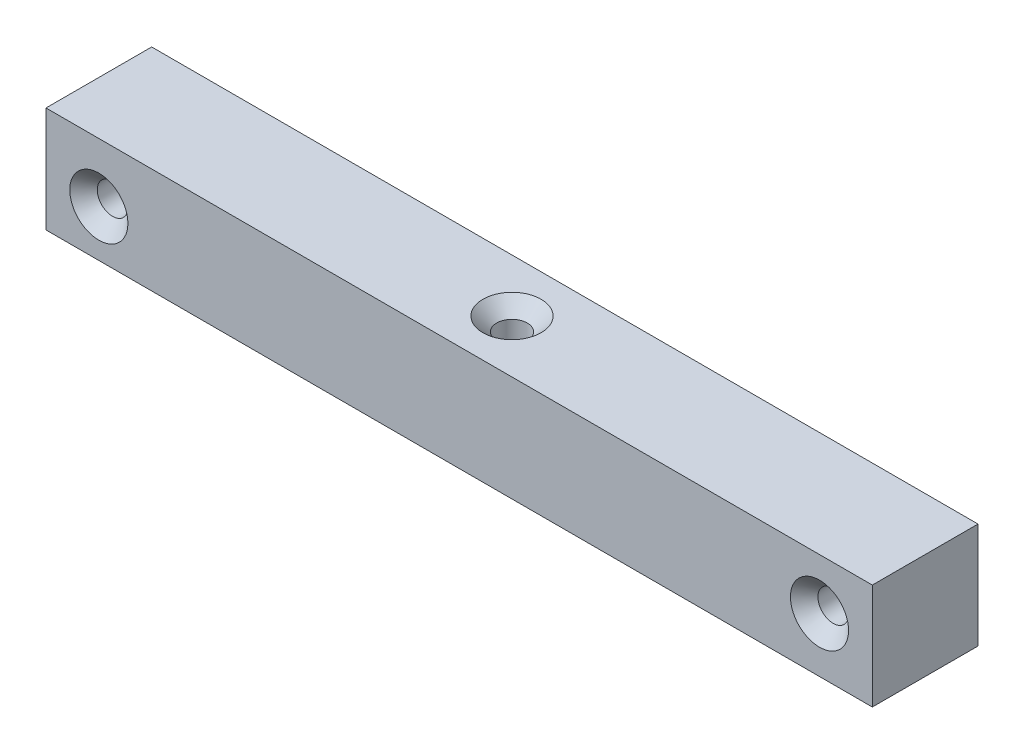
ISO-10303-21;
HEADER;
FILE_DESCRIPTION(('STEP AP214'),'2;1');
FILE_NAME('part.step','',(''),(''),'','','');
FILE_SCHEMA(('AUTOMOTIVE_DESIGN { 1 0 10303 214 1 1 1 1 }'));
ENDSEC;
DATA;
#1=APPLICATION_CONTEXT('core data for automotive mechanical design processes');
#2=APPLICATION_PROTOCOL_DEFINITION('international standard','automotive_design',2000,#1);
#3=PRODUCT_CONTEXT('',#1,'mechanical');
#4=PRODUCT('Part','Part','',(#3));
#5=PRODUCT_RELATED_PRODUCT_CATEGORY('part','',(#4));
#6=PRODUCT_DEFINITION_FORMATION('','',#4);
#7=PRODUCT_DEFINITION_CONTEXT('part definition',#1,'design');
#8=PRODUCT_DEFINITION('design','',#6,#7);
#9=PRODUCT_DEFINITION_SHAPE('','',#8);
#10=(LENGTH_UNIT() NAMED_UNIT(*) SI_UNIT(.MILLI.,.METRE.));
#11=(NAMED_UNIT(*) PLANE_ANGLE_UNIT() SI_UNIT($,.RADIAN.));
#12=(NAMED_UNIT(*) SI_UNIT($,.STERADIAN.) SOLID_ANGLE_UNIT());
#13=UNCERTAINTY_MEASURE_WITH_UNIT(LENGTH_MEASURE(1.E-05),#10,'distance_accuracy_value','');
#14=(GEOMETRIC_REPRESENTATION_CONTEXT(3) GLOBAL_UNCERTAINTY_ASSIGNED_CONTEXT((#13)) GLOBAL_UNIT_ASSIGNED_CONTEXT((#10,
#11,#12)) REPRESENTATION_CONTEXT('',''));
#15=CARTESIAN_POINT('',(0.,0.,0.));
#16=DIRECTION('',(0.,0.,1.));
#17=DIRECTION('',(1.,0.,0.));
#18=AXIS2_PLACEMENT_3D('',#15,#16,#17);
#19=CARTESIAN_POINT('',(0.,10.,0.));
#20=DIRECTION('',(-1.,0.,0.));
#21=DIRECTION('',(0.,0.,1.));
#22=AXIS2_PLACEMENT_3D('',#19,#20,#21);
#23=PLANE('',#22);
#24=DIRECTION('',(0.,0.,-1.));
#25=VECTOR('',#24,1.);
#26=CARTESIAN_POINT('',(0.,0.,0.));
#27=LINE('',#26,#25);
#28=CARTESIAN_POINT('',(0.,0.,10.));
#29=VERTEX_POINT('',#28);
#30=CARTESIAN_POINT('',(0.,0.,0.));
#31=VERTEX_POINT('',#30);
#32=EDGE_CURVE('E107',#29,#31,#27,.T.);
#33=ORIENTED_EDGE('',*,*,#32,.T.);
#34=DIRECTION('',(0.,-1.,0.));
#35=VECTOR('',#34,1.);
#36=CARTESIAN_POINT('',(0.,10.,0.));
#37=LINE('',#36,#35);
#38=CARTESIAN_POINT('',(0.,10.,0.));
#39=VERTEX_POINT('',#38);
#40=EDGE_CURVE('E11',#39,#31,#37,.T.);
#41=ORIENTED_EDGE('',*,*,#40,.F.);
#42=DIRECTION('',(0.,0.,-1.));
#43=VECTOR('',#42,1.);
#44=CARTESIAN_POINT('',(0.,10.,0.));
#45=LINE('',#44,#43);
#46=CARTESIAN_POINT('',(0.,10.,10.));
#47=VERTEX_POINT('',#46);
#48=EDGE_CURVE('E91',#47,#39,#45,.T.);
#49=ORIENTED_EDGE('',*,*,#48,.F.);
#50=DIRECTION('',(0.,-1.,0.));
#51=VECTOR('',#50,1.);
#52=CARTESIAN_POINT('',(0.,10.,10.));
#53=LINE('',#52,#51);
#54=EDGE_CURVE('E103',#47,#29,#53,.T.);
#55=ORIENTED_EDGE('',*,*,#54,.T.);
#56=EDGE_LOOP('',(#33,#41,#49,#55));
#57=FACE_BOUND('',#56,.T.);
#58=ADVANCED_FACE('F39',(#57),#23,.F.);
#59=CARTESIAN_POINT('',(0.,10.,0.));
#60=DIRECTION('',(0.,0.,1.));
#61=DIRECTION('',(1.,0.,0.));
#62=AXIS2_PLACEMENT_3D('',#59,#60,#61);
#63=PLANE('',#62);
#64=CARTESIAN_POINT('',(-73.199,4.41454757788051,0.));
#65=DIRECTION('',(0.,0.,1.));
#66=DIRECTION('',(1.,0.,0.));
#67=AXIS2_PLACEMENT_3D('',#64,#65,#66);
#68=CIRCLE('',#67,1.44999999999999);
#69=CARTESIAN_POINT('',(-71.749,4.41454757788051,0.));
#70=VERTEX_POINT('',#69);
#71=EDGE_CURVE('E139',#70,#70,#68,.T.);
#72=ORIENTED_EDGE('',*,*,#71,.T.);
#73=EDGE_LOOP('',(#72));
#74=FACE_BOUND('',#73,.T.);
#75=CARTESIAN_POINT('',(-5.,5.154214904735,0.));
#76=DIRECTION('',(0.,0.,1.));
#77=DIRECTION('',(1.,0.,0.));
#78=AXIS2_PLACEMENT_3D('',#75,#76,#77);
#79=CIRCLE('',#78,1.45);
#80=CARTESIAN_POINT('',(-3.55,5.154214904735,0.));
#81=VERTEX_POINT('',#80);
#82=EDGE_CURVE('E111',#81,#81,#79,.T.);
#83=ORIENTED_EDGE('',*,*,#82,.T.);
#84=EDGE_LOOP('',(#83));
#85=FACE_BOUND('',#84,.T.);
#86=DIRECTION('',(-1.,0.,0.));
#87=VECTOR('',#86,1.);
#88=CARTESIAN_POINT('',(0.,0.,0.));
#89=LINE('',#88,#87);
#90=CARTESIAN_POINT('',(-78.2,0.,0.));
#91=VERTEX_POINT('',#90);
#92=EDGE_CURVE('E96',#31,#91,#89,.T.);
#93=ORIENTED_EDGE('',*,*,#92,.T.);
#94=DIRECTION('',(0.,-1.,0.));
#95=VECTOR('',#94,1.);
#96=CARTESIAN_POINT('',(-78.2,10.,0.));
#97=LINE('',#96,#95);
#98=CARTESIAN_POINT('',(-78.2,10.,0.));
#99=VERTEX_POINT('',#98);
#100=EDGE_CURVE('E48',#99,#91,#97,.T.);
#101=ORIENTED_EDGE('',*,*,#100,.F.);
#102=DIRECTION('',(-1.,0.,0.));
#103=VECTOR('',#102,1.);
#104=CARTESIAN_POINT('',(0.,10.,0.));
#105=LINE('',#104,#103);
#106=EDGE_CURVE('E86',#39,#99,#105,.T.);
#107=ORIENTED_EDGE('',*,*,#106,.F.);
#108=ORIENTED_EDGE('',*,*,#40,.T.);
#109=EDGE_LOOP('',(#93,#101,#107,#108));
#110=FACE_BOUND('',#109,.T.);
#111=ADVANCED_FACE('F95',(#74,#85,#110),#63,.F.);
#112=CARTESIAN_POINT('',(-78.2,10.,0.));
#113=DIRECTION('',(1.,0.,0.));
#114=DIRECTION('',(0.,0.,-1.));
#115=AXIS2_PLACEMENT_3D('',#112,#113,#114);
#116=PLANE('',#115);
#117=DIRECTION('',(0.,0.,1.));
#118=VECTOR('',#117,1.);
#119=CARTESIAN_POINT('',(-78.2,0.,0.));
#120=LINE('',#119,#118);
#121=CARTESIAN_POINT('',(-78.2,0.,10.));
#122=VERTEX_POINT('',#121);
#123=EDGE_CURVE('E73',#91,#122,#120,.T.);
#124=ORIENTED_EDGE('',*,*,#123,.T.);
#125=DIRECTION('',(0.,-1.,0.));
#126=VECTOR('',#125,1.);
#127=CARTESIAN_POINT('',(-78.2,10.,10.));
#128=LINE('',#127,#126);
#129=CARTESIAN_POINT('',(-78.2,10.,10.));
#130=VERTEX_POINT('',#129);
#131=EDGE_CURVE('E98',#130,#122,#128,.T.);
#132=ORIENTED_EDGE('',*,*,#131,.F.);
#133=DIRECTION('',(0.,0.,1.));
#134=VECTOR('',#133,1.);
#135=CARTESIAN_POINT('',(-78.2,10.,0.));
#136=LINE('',#135,#134);
#137=EDGE_CURVE('E89',#99,#130,#136,.T.);
#138=ORIENTED_EDGE('',*,*,#137,.F.);
#139=ORIENTED_EDGE('',*,*,#100,.T.);
#140=EDGE_LOOP('',(#124,#132,#138,#139));
#141=FACE_BOUND('',#140,.T.);
#142=ADVANCED_FACE('F99',(#141),#116,.F.);
#143=CARTESIAN_POINT('',(0.,10.,10.));
#144=DIRECTION('',(0.,0.,-1.));
#145=DIRECTION('',(-1.,0.,0.));
#146=AXIS2_PLACEMENT_3D('',#143,#144,#145);
#147=PLANE('',#146);
#148=CARTESIAN_POINT('',(-73.199,4.41454757788051,10.));
#149=DIRECTION('',(0.,0.,1.));
#150=DIRECTION('',(1.,0.,0.));
#151=AXIS2_PLACEMENT_3D('',#148,#149,#150);
#152=CIRCLE('',#151,2.75);
#153=CARTESIAN_POINT('',(-70.449,4.41454757788051,10.));
#154=VERTEX_POINT('',#153);
#155=EDGE_CURVE('E147',#154,#154,#152,.T.);
#156=ORIENTED_EDGE('',*,*,#155,.F.);
#157=EDGE_LOOP('',(#156));
#158=FACE_BOUND('',#157,.T.);
#159=CARTESIAN_POINT('',(-5.,5.154214904735,10.));
#160=DIRECTION('',(0.,0.,1.));
#161=DIRECTION('',(1.,0.,0.));
#162=AXIS2_PLACEMENT_3D('',#159,#160,#161);
#163=CIRCLE('',#162,2.75);
#164=CARTESIAN_POINT('',(-2.25,5.154214904735,10.));
#165=VERTEX_POINT('',#164);
#166=EDGE_CURVE('E135',#165,#165,#163,.T.);
#167=ORIENTED_EDGE('',*,*,#166,.F.);
#168=EDGE_LOOP('',(#167));
#169=FACE_BOUND('',#168,.T.);
#170=DIRECTION('',(1.,0.,0.));
#171=VECTOR('',#170,1.);
#172=CARTESIAN_POINT('',(0.,0.,10.));
#173=LINE('',#172,#171);
#174=EDGE_CURVE('E79',#122,#29,#173,.T.);
#175=ORIENTED_EDGE('',*,*,#174,.T.);
#176=ORIENTED_EDGE('',*,*,#54,.F.);
#177=DIRECTION('',(1.,0.,0.));
#178=VECTOR('',#177,1.);
#179=CARTESIAN_POINT('',(0.,10.,10.));
#180=LINE('',#179,#178);
#181=EDGE_CURVE('E56',#130,#47,#180,.T.);
#182=ORIENTED_EDGE('',*,*,#181,.F.);
#183=ORIENTED_EDGE('',*,*,#131,.T.);
#184=EDGE_LOOP('',(#175,#176,#182,#183));
#185=FACE_BOUND('',#184,.T.);
#186=ADVANCED_FACE('F121',(#158,#169,#185),#147,.F.);
#187=CARTESIAN_POINT('',(0.,10.,0.));
#188=DIRECTION('',(0.,-1.,0.));
#189=DIRECTION('',(0.,0.,-1.));
#190=AXIS2_PLACEMENT_3D('',#187,#188,#189);
#191=PLANE('',#190);
#192=CARTESIAN_POINT('',(-39.1,10.,5.));
#193=DIRECTION('',(0.,1.,0.));
#194=DIRECTION('',(0.,0.,1.));
#195=AXIS2_PLACEMENT_3D('',#192,#193,#194);
#196=CIRCLE('',#195,2.75);
#197=CARTESIAN_POINT('',(-39.1,10.,7.75));
#198=VERTEX_POINT('',#197);
#199=EDGE_CURVE('E159',#198,#198,#196,.T.);
#200=ORIENTED_EDGE('',*,*,#199,.F.);
#201=EDGE_LOOP('',(#200));
#202=FACE_BOUND('',#201,.T.);
#203=ORIENTED_EDGE('',*,*,#48,.T.);
#204=ORIENTED_EDGE('',*,*,#106,.T.);
#205=ORIENTED_EDGE('',*,*,#137,.T.);
#206=ORIENTED_EDGE('',*,*,#181,.T.);
#207=EDGE_LOOP('',(#203,#204,#205,#206));
#208=FACE_BOUND('',#207,.T.);
#209=ADVANCED_FACE('F87',(#202,#208),#191,.F.);
#210=CARTESIAN_POINT('',(0.,0.,0.));
#211=DIRECTION('',(0.,-1.,0.));
#212=DIRECTION('',(0.,0.,-1.));
#213=AXIS2_PLACEMENT_3D('',#210,#211,#212);
#214=PLANE('',#213);
#215=CARTESIAN_POINT('',(-39.1,0.,5.));
#216=DIRECTION('',(0.,1.,0.));
#217=DIRECTION('',(0.,0.,1.));
#218=AXIS2_PLACEMENT_3D('',#215,#216,#217);
#219=CIRCLE('',#218,1.45);
#220=CARTESIAN_POINT('',(-39.1,0.,6.45));
#221=VERTEX_POINT('',#220);
#222=EDGE_CURVE('E151',#221,#221,#219,.T.);
#223=ORIENTED_EDGE('',*,*,#222,.T.);
#224=EDGE_LOOP('',(#223));
#225=FACE_BOUND('',#224,.T.);
#226=ORIENTED_EDGE('',*,*,#32,.F.);
#227=ORIENTED_EDGE('',*,*,#174,.F.);
#228=ORIENTED_EDGE('',*,*,#123,.F.);
#229=ORIENTED_EDGE('',*,*,#92,.F.);
#230=EDGE_LOOP('',(#226,#227,#228,#229));
#231=FACE_BOUND('',#230,.T.);
#232=ADVANCED_FACE('F124',(#225,#231),#214,.T.);
#233=CARTESIAN_POINT('',(-5.,5.154214904735,10.));
#234=DIRECTION('',(0.,0.,1.));
#235=DIRECTION('',(1.,0.,0.));
#236=AXIS2_PLACEMENT_3D('',#233,#234,#235);
#237=CYLINDRICAL_SURFACE('',#236,1.45);
#238=ORIENTED_EDGE('',*,*,#82,.F.);
#239=EDGE_LOOP('',(#238));
#240=FACE_BOUND('',#239,.T.);
#241=CARTESIAN_POINT('',(-5.,5.154214904735,8.7));
#242=DIRECTION('',(0.,0.,1.));
#243=DIRECTION('',(1.,0.,0.));
#244=AXIS2_PLACEMENT_3D('',#241,#242,#243);
#245=CIRCLE('',#244,1.45);
#246=CARTESIAN_POINT('',(-3.55,5.154214904735,8.7));
#247=VERTEX_POINT('',#246);
#248=EDGE_CURVE('E131',#247,#247,#245,.T.);
#249=ORIENTED_EDGE('',*,*,#248,.T.);
#250=EDGE_LOOP('',(#249));
#251=FACE_BOUND('',#250,.T.);
#252=ADVANCED_FACE('F172',(#240,#251),#237,.F.);
#253=CARTESIAN_POINT('',(-5.,5.154214904735,10.));
#254=DIRECTION('',(0.,0.,1.));
#255=DIRECTION('',(1.,0.,0.));
#256=AXIS2_PLACEMENT_3D('',#253,#254,#255);
#257=CONICAL_SURFACE('',#256,2.75,0.785398163397448);
#258=ORIENTED_EDGE('',*,*,#248,.F.);
#259=EDGE_LOOP('',(#258));
#260=FACE_BOUND('',#259,.T.);
#261=ORIENTED_EDGE('',*,*,#166,.T.);
#262=EDGE_LOOP('',(#261));
#263=FACE_BOUND('',#262,.T.);
#264=ADVANCED_FACE('F193',(#260,#263),#257,.F.);
#265=CARTESIAN_POINT('',(-73.199,4.41454757788051,10.));
#266=DIRECTION('',(0.,0.,1.));
#267=DIRECTION('',(1.,0.,0.));
#268=AXIS2_PLACEMENT_3D('',#265,#266,#267);
#269=CYLINDRICAL_SURFACE('',#268,1.44999999999999);
#270=ORIENTED_EDGE('',*,*,#71,.F.);
#271=EDGE_LOOP('',(#270));
#272=FACE_BOUND('',#271,.T.);
#273=CARTESIAN_POINT('',(-73.199,4.41454757788051,8.69999999999999));
#274=DIRECTION('',(0.,0.,1.));
#275=DIRECTION('',(1.,0.,0.));
#276=AXIS2_PLACEMENT_3D('',#273,#274,#275);
#277=CIRCLE('',#276,1.44999999999999);
#278=CARTESIAN_POINT('',(-71.749,4.41454757788051,8.69999999999999));
#279=VERTEX_POINT('',#278);
#280=EDGE_CURVE('E143',#279,#279,#277,.T.);
#281=ORIENTED_EDGE('',*,*,#280,.T.);
#282=EDGE_LOOP('',(#281));
#283=FACE_BOUND('',#282,.T.);
#284=ADVANCED_FACE('F198',(#272,#283),#269,.F.);
#285=CARTESIAN_POINT('',(-73.199,4.41454757788051,10.));
#286=DIRECTION('',(0.,0.,1.));
#287=DIRECTION('',(1.,0.,0.));
#288=AXIS2_PLACEMENT_3D('',#285,#286,#287);
#289=CONICAL_SURFACE('',#288,2.75,0.785398163397448);
#290=ORIENTED_EDGE('',*,*,#280,.F.);
#291=EDGE_LOOP('',(#290));
#292=FACE_BOUND('',#291,.T.);
#293=ORIENTED_EDGE('',*,*,#155,.T.);
#294=EDGE_LOOP('',(#293));
#295=FACE_BOUND('',#294,.T.);
#296=ADVANCED_FACE('F205',(#292,#295),#289,.F.);
#297=CARTESIAN_POINT('',(-39.1,10.,5.));
#298=DIRECTION('',(0.,1.,0.));
#299=DIRECTION('',(0.,0.,1.));
#300=AXIS2_PLACEMENT_3D('',#297,#298,#299);
#301=CYLINDRICAL_SURFACE('',#300,1.44999999999999);
#302=ORIENTED_EDGE('',*,*,#222,.F.);
#303=EDGE_LOOP('',(#302));
#304=FACE_BOUND('',#303,.T.);
#305=CARTESIAN_POINT('',(-39.1,8.69999999999999,5.));
#306=DIRECTION('',(0.,1.,0.));
#307=DIRECTION('',(0.,0.,1.));
#308=AXIS2_PLACEMENT_3D('',#305,#306,#307);
#309=CIRCLE('',#308,1.44999999999999);
#310=CARTESIAN_POINT('',(-39.1,8.69999999999999,6.44999999999999));
#311=VERTEX_POINT('',#310);
#312=EDGE_CURVE('E155',#311,#311,#309,.T.);
#313=ORIENTED_EDGE('',*,*,#312,.T.);
#314=EDGE_LOOP('',(#313));
#315=FACE_BOUND('',#314,.T.);
#316=ADVANCED_FACE('F211',(#304,#315),#301,.F.);
#317=CARTESIAN_POINT('',(-39.1,10.,5.));
#318=DIRECTION('',(0.,1.,0.));
#319=DIRECTION('',(0.,0.,1.));
#320=AXIS2_PLACEMENT_3D('',#317,#318,#319);
#321=CONICAL_SURFACE('',#320,2.75,0.785398163397448);
#322=ORIENTED_EDGE('',*,*,#312,.F.);
#323=EDGE_LOOP('',(#322));
#324=FACE_BOUND('',#323,.T.);
#325=ORIENTED_EDGE('',*,*,#199,.T.);
#326=EDGE_LOOP('',(#325));
#327=FACE_BOUND('',#326,.T.);
#328=ADVANCED_FACE('F164',(#324,#327),#321,.F.);
#329=CLOSED_SHELL('',(#58,#111,#142,#186,#209,#232,#252,#264,#284,#296,#316,#328));
#330=MANIFOLD_SOLID_BREP('B2',#329);
#331=ADVANCED_BREP_SHAPE_REPRESENTATION('',(#18,#330),#14);
#332=SHAPE_DEFINITION_REPRESENTATION(#9,#331);
ENDSEC;
END-ISO-10303-21;
